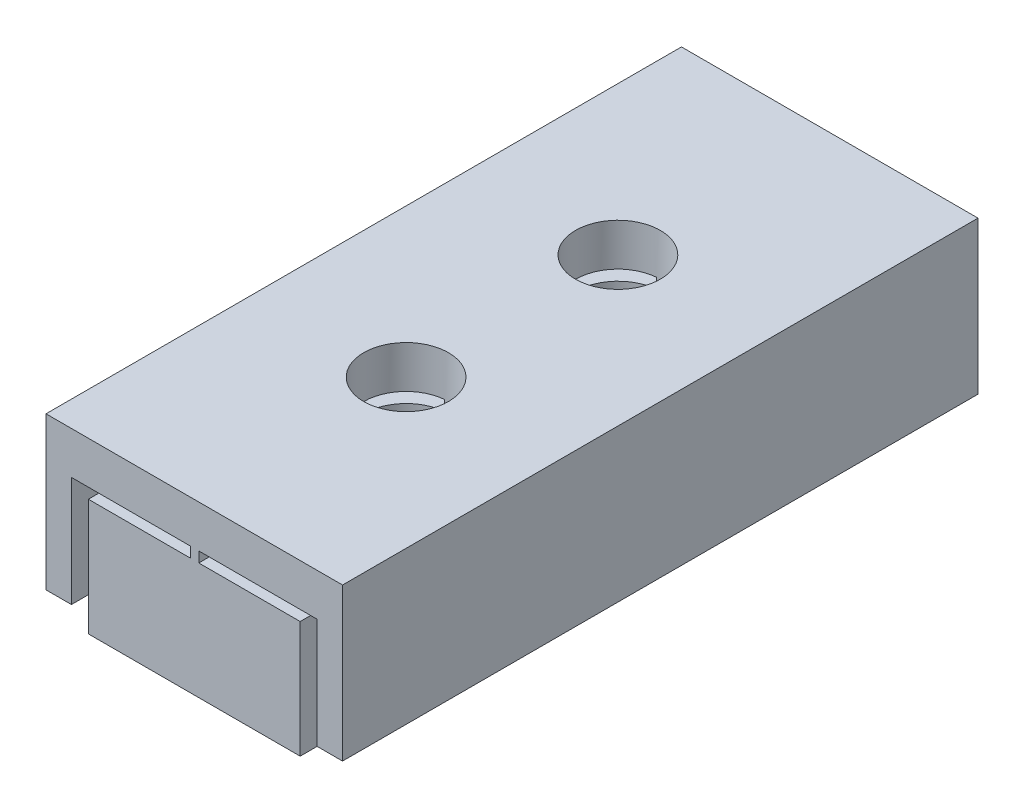
ISO-10303-21;
HEADER;
FILE_DESCRIPTION(('STEP AP214'),'2;1');
FILE_NAME('part.step','',(''),(''),'','','');
FILE_SCHEMA(('AUTOMOTIVE_DESIGN { 1 0 10303 214 1 1 1 1 }'));
ENDSEC;
DATA;
#1=APPLICATION_CONTEXT('core data for automotive mechanical design processes');
#2=APPLICATION_PROTOCOL_DEFINITION('international standard','automotive_design',2000,#1);
#3=PRODUCT_CONTEXT('',#1,'mechanical');
#4=PRODUCT('Part','Part','',(#3));
#5=PRODUCT_RELATED_PRODUCT_CATEGORY('part','',(#4));
#6=PRODUCT_DEFINITION_FORMATION('','',#4);
#7=PRODUCT_DEFINITION_CONTEXT('part definition',#1,'design');
#8=PRODUCT_DEFINITION('design','',#6,#7);
#9=PRODUCT_DEFINITION_SHAPE('','',#8);
#10=(LENGTH_UNIT() NAMED_UNIT(*) SI_UNIT(.MILLI.,.METRE.));
#11=(NAMED_UNIT(*) PLANE_ANGLE_UNIT() SI_UNIT($,.RADIAN.));
#12=(NAMED_UNIT(*) SI_UNIT($,.STERADIAN.) SOLID_ANGLE_UNIT());
#13=UNCERTAINTY_MEASURE_WITH_UNIT(LENGTH_MEASURE(1.E-05),#10,'distance_accuracy_value','');
#14=(GEOMETRIC_REPRESENTATION_CONTEXT(3) GLOBAL_UNCERTAINTY_ASSIGNED_CONTEXT((#13)) GLOBAL_UNIT_ASSIGNED_CONTEXT((#10,
#11,#12)) REPRESENTATION_CONTEXT('',''));
#15=CARTESIAN_POINT('',(0.,0.,0.));
#16=DIRECTION('',(0.,0.,1.));
#17=DIRECTION('',(1.,0.,0.));
#18=AXIS2_PLACEMENT_3D('',#15,#16,#17);
#19=CARTESIAN_POINT('',(0.,3.,0.));
#20=DIRECTION('',(-1.,0.,0.));
#21=DIRECTION('',(0.,0.,1.));
#22=AXIS2_PLACEMENT_3D('',#19,#20,#21);
#23=PLANE('',#22);
#24=DIRECTION('',(0.,-1.,0.));
#25=VECTOR('',#24,1.);
#26=CARTESIAN_POINT('',(0.,3.,0.));
#27=LINE('',#26,#25);
#28=CARTESIAN_POINT('',(0.,2.75359951218224,0.));
#29=VERTEX_POINT('',#28);
#30=CARTESIAN_POINT('',(0.,0.,0.));
#31=VERTEX_POINT('',#30);
#32=EDGE_CURVE('E269',#29,#31,#27,.T.);
#33=ORIENTED_EDGE('',*,*,#32,.F.);
#34=DIRECTION('',(0.,0.,1.));
#35=VECTOR('',#34,1.);
#36=CARTESIAN_POINT('',(0.,2.75359951218224,0.));
#37=LINE('',#36,#35);
#38=CARTESIAN_POINT('',(0.,2.75359951218224,15.));
#39=VERTEX_POINT('',#38);
#40=EDGE_CURVE('E334',#29,#39,#37,.T.);
#41=ORIENTED_EDGE('',*,*,#40,.T.);
#42=DIRECTION('',(0.,-1.,0.));
#43=VECTOR('',#42,1.);
#44=CARTESIAN_POINT('',(0.,3.,15.));
#45=LINE('',#44,#43);
#46=CARTESIAN_POINT('',(0.,0.,15.));
#47=VERTEX_POINT('',#46);
#48=EDGE_CURVE('E263',#39,#47,#45,.T.);
#49=ORIENTED_EDGE('',*,*,#48,.T.);
#50=DIRECTION('',(0.,0.,-1.));
#51=VECTOR('',#50,1.);
#52=CARTESIAN_POINT('',(0.,0.,0.));
#53=LINE('',#52,#51);
#54=EDGE_CURVE('E246',#47,#31,#53,.T.);
#55=ORIENTED_EDGE('',*,*,#54,.T.);
#56=EDGE_LOOP('',(#33,#41,#49,#55));
#57=FACE_BOUND('',#56,.T.);
#58=ADVANCED_FACE('F38',(#57),#23,.F.);
#59=CARTESIAN_POINT('',(0.,3.,0.));
#60=DIRECTION('',(0.,0.,1.));
#61=DIRECTION('',(1.,0.,0.));
#62=AXIS2_PLACEMENT_3D('',#59,#60,#61);
#63=PLANE('',#62);
#64=DIRECTION('',(0.,-1.,0.));
#65=VECTOR('',#64,1.);
#66=CARTESIAN_POINT('',(0.999999999999999,4.,0.));
#67=LINE('',#66,#65);
#68=CARTESIAN_POINT('',(0.999999999999999,4.,0.));
#69=VERTEX_POINT('',#68);
#70=CARTESIAN_POINT('',(0.999999999999999,0.4,0.));
#71=VERTEX_POINT('',#70);
#72=EDGE_CURVE('E243',#69,#71,#67,.T.);
#73=ORIENTED_EDGE('',*,*,#72,.T.);
#74=DIRECTION('',(1.,0.,0.));
#75=VECTOR('',#74,1.);
#76=CARTESIAN_POINT('',(0.4,0.4,0.));
#77=LINE('',#76,#75);
#78=CARTESIAN_POINT('',(0.4,0.4,0.));
#79=VERTEX_POINT('',#78);
#80=EDGE_CURVE('E199',#79,#71,#77,.T.);
#81=ORIENTED_EDGE('',*,*,#80,.F.);
#82=DIRECTION('',(0.,1.,0.));
#83=VECTOR('',#82,1.);
#84=CARTESIAN_POINT('',(0.4,0.,0.));
#85=LINE('',#84,#83);
#86=CARTESIAN_POINT('',(0.4,3.,0.));
#87=VERTEX_POINT('',#86);
#88=EDGE_CURVE('E229',#79,#87,#85,.T.);
#89=ORIENTED_EDGE('',*,*,#88,.T.);
#90=DIRECTION('',(-1.,0.,0.));
#91=VECTOR('',#90,1.);
#92=CARTESIAN_POINT('',(0.4,3.,0.));
#93=LINE('',#92,#91);
#94=CARTESIAN_POINT('',(-2.39325068934878,3.,0.));
#95=VERTEX_POINT('',#94);
#96=EDGE_CURVE('E233',#87,#95,#93,.T.);
#97=ORIENTED_EDGE('',*,*,#96,.T.);
#98=DIRECTION('',(0.,-1.,0.));
#99=VECTOR('',#98,1.);
#100=CARTESIAN_POINT('',(-2.39325068934878,3.,0.));
#101=LINE('',#100,#99);
#102=CARTESIAN_POINT('',(-2.39325068934878,2.75359951218224,0.));
#103=VERTEX_POINT('',#102);
#104=EDGE_CURVE('E323',#95,#103,#101,.T.);
#105=ORIENTED_EDGE('',*,*,#104,.T.);
#106=DIRECTION('',(1.,0.,0.));
#107=VECTOR('',#106,1.);
#108=CARTESIAN_POINT('',(0.,2.75359951218224,0.));
#109=LINE('',#108,#107);
#110=EDGE_CURVE('E326',#103,#29,#109,.T.);
#111=ORIENTED_EDGE('',*,*,#110,.T.);
#112=ORIENTED_EDGE('',*,*,#32,.T.);
#113=DIRECTION('',(-1.,0.,0.));
#114=VECTOR('',#113,1.);
#115=CARTESIAN_POINT('',(0.,0.,0.));
#116=LINE('',#115,#114);
#117=CARTESIAN_POINT('',(-5.,0.,0.));
#118=VERTEX_POINT('',#117);
#119=EDGE_CURVE('E254',#31,#118,#116,.T.);
#120=ORIENTED_EDGE('',*,*,#119,.T.);
#121=DIRECTION('',(0.,-1.,0.));
#122=VECTOR('',#121,1.);
#123=CARTESIAN_POINT('',(-5.,3.,0.));
#124=LINE('',#123,#122);
#125=CARTESIAN_POINT('',(-5.,2.75359951218224,0.));
#126=VERTEX_POINT('',#125);
#127=EDGE_CURVE('E267',#126,#118,#124,.T.);
#128=ORIENTED_EDGE('',*,*,#127,.F.);
#129=DIRECTION('',(1.,0.,0.));
#130=VECTOR('',#129,1.);
#131=CARTESIAN_POINT('',(-5.,2.75359951218224,0.));
#132=LINE('',#131,#130);
#133=CARTESIAN_POINT('',(-2.59036710602787,2.75359951218224,0.));
#134=VERTEX_POINT('',#133);
#135=EDGE_CURVE('E406',#126,#134,#132,.T.);
#136=ORIENTED_EDGE('',*,*,#135,.T.);
#137=DIRECTION('',(0.,1.,0.));
#138=VECTOR('',#137,1.);
#139=CARTESIAN_POINT('',(-2.59036710602787,3.,0.));
#140=LINE('',#139,#138);
#141=CARTESIAN_POINT('',(-2.59036710602787,3.,0.));
#142=VERTEX_POINT('',#141);
#143=EDGE_CURVE('E322',#134,#142,#140,.T.);
#144=ORIENTED_EDGE('',*,*,#143,.T.);
#145=CARTESIAN_POINT('',(-5.4,3.,0.));
#146=VERTEX_POINT('',#145);
#147=EDGE_CURVE('E231',#142,#146,#93,.T.);
#148=ORIENTED_EDGE('',*,*,#147,.T.);
#149=DIRECTION('',(0.,-1.,0.));
#150=VECTOR('',#149,1.);
#151=CARTESIAN_POINT('',(-5.4,3.,0.));
#152=LINE('',#151,#150);
#153=CARTESIAN_POINT('',(-5.4,0.400000000000001,0.));
#154=VERTEX_POINT('',#153);
#155=EDGE_CURVE('E235',#146,#154,#152,.T.);
#156=ORIENTED_EDGE('',*,*,#155,.T.);
#157=DIRECTION('',(1.,0.,0.));
#158=VECTOR('',#157,1.);
#159=CARTESIAN_POINT('',(-6.,0.400000000000001,0.));
#160=LINE('',#159,#158);
#161=CARTESIAN_POINT('',(-6.,0.400000000000001,0.));
#162=VERTEX_POINT('',#161);
#163=EDGE_CURVE('E52',#162,#154,#160,.T.);
#164=ORIENTED_EDGE('',*,*,#163,.F.);
#165=DIRECTION('',(0.,1.,0.));
#166=VECTOR('',#165,1.);
#167=CARTESIAN_POINT('',(-6.,0.,0.));
#168=LINE('',#167,#166);
#169=CARTESIAN_POINT('',(-6.,4.,0.));
#170=VERTEX_POINT('',#169);
#171=EDGE_CURVE('E238',#162,#170,#168,.T.);
#172=ORIENTED_EDGE('',*,*,#171,.T.);
#173=DIRECTION('',(1.,0.,0.));
#174=VECTOR('',#173,1.);
#175=CARTESIAN_POINT('',(-6.,4.,0.));
#176=LINE('',#175,#174);
#177=EDGE_CURVE('E240',#170,#69,#176,.T.);
#178=ORIENTED_EDGE('',*,*,#177,.T.);
#179=EDGE_LOOP('',(#73,#81,#89,#97,#105,#111,#112,#120,#128,#136,#144,#148,#156,#164,#172,#178));
#180=FACE_BOUND('',#179,.T.);
#181=ADVANCED_FACE('F396',(#180),#63,.F.);
#182=CARTESIAN_POINT('',(-5.,3.,0.));
#183=DIRECTION('',(1.,0.,0.));
#184=DIRECTION('',(0.,0.,-1.));
#185=AXIS2_PLACEMENT_3D('',#182,#183,#184);
#186=PLANE('',#185);
#187=DIRECTION('',(0.,-1.,0.));
#188=VECTOR('',#187,1.);
#189=CARTESIAN_POINT('',(-5.,3.,15.));
#190=LINE('',#189,#188);
#191=CARTESIAN_POINT('',(-5.,2.75359951218224,15.));
#192=VERTEX_POINT('',#191);
#193=CARTESIAN_POINT('',(-5.,0.,15.));
#194=VERTEX_POINT('',#193);
#195=EDGE_CURVE('E265',#192,#194,#190,.T.);
#196=ORIENTED_EDGE('',*,*,#195,.F.);
#197=DIRECTION('',(0.,0.,1.));
#198=VECTOR('',#197,1.);
#199=CARTESIAN_POINT('',(-5.,2.75359951218224,0.));
#200=LINE('',#199,#198);
#201=EDGE_CURVE('E320',#126,#192,#200,.T.);
#202=ORIENTED_EDGE('',*,*,#201,.F.);
#203=ORIENTED_EDGE('',*,*,#127,.T.);
#204=DIRECTION('',(0.,0.,1.));
#205=VECTOR('',#204,1.);
#206=CARTESIAN_POINT('',(-5.,0.,0.));
#207=LINE('',#206,#205);
#208=EDGE_CURVE('E257',#118,#194,#207,.T.);
#209=ORIENTED_EDGE('',*,*,#208,.T.);
#210=EDGE_LOOP('',(#196,#202,#203,#209));
#211=FACE_BOUND('',#210,.T.);
#212=ADVANCED_FACE('F439',(#211),#186,.F.);
#213=CARTESIAN_POINT('',(0.,3.,15.));
#214=DIRECTION('',(0.,0.,-1.));
#215=DIRECTION('',(-1.,0.,0.));
#216=AXIS2_PLACEMENT_3D('',#213,#214,#215);
#217=PLANE('',#216);
#218=DIRECTION('',(0.,1.,0.));
#219=VECTOR('',#218,1.);
#220=CARTESIAN_POINT('',(0.400000000000002,0.,15.));
#221=LINE('',#220,#219);
#222=CARTESIAN_POINT('',(0.400000000000002,0.4,15.));
#223=VERTEX_POINT('',#222);
#224=CARTESIAN_POINT('',(0.400000000000002,3.,15.));
#225=VERTEX_POINT('',#224);
#226=EDGE_CURVE('E214',#223,#225,#221,.T.);
#227=ORIENTED_EDGE('',*,*,#226,.F.);
#228=DIRECTION('',(1.,0.,0.));
#229=VECTOR('',#228,1.);
#230=CARTESIAN_POINT('',(0.400000000000002,0.4,15.));
#231=LINE('',#230,#229);
#232=CARTESIAN_POINT('',(1.,0.4,15.));
#233=VERTEX_POINT('',#232);
#234=EDGE_CURVE('E60',#223,#233,#231,.T.);
#235=ORIENTED_EDGE('',*,*,#234,.T.);
#236=DIRECTION('',(0.,-1.,0.));
#237=VECTOR('',#236,1.);
#238=CARTESIAN_POINT('',(1.,4.,15.));
#239=LINE('',#238,#237);
#240=CARTESIAN_POINT('',(1.,4.,15.));
#241=VERTEX_POINT('',#240);
#242=EDGE_CURVE('E212',#241,#233,#239,.T.);
#243=ORIENTED_EDGE('',*,*,#242,.F.);
#244=DIRECTION('',(1.,0.,0.));
#245=VECTOR('',#244,1.);
#246=CARTESIAN_POINT('',(-6.,4.,15.));
#247=LINE('',#246,#245);
#248=CARTESIAN_POINT('',(-6.,4.,15.));
#249=VERTEX_POINT('',#248);
#250=EDGE_CURVE('E220',#249,#241,#247,.T.);
#251=ORIENTED_EDGE('',*,*,#250,.F.);
#252=DIRECTION('',(0.,1.,0.));
#253=VECTOR('',#252,1.);
#254=CARTESIAN_POINT('',(-6.,0.,15.));
#255=LINE('',#254,#253);
#256=CARTESIAN_POINT('',(-6.,0.400000000000001,15.));
#257=VERTEX_POINT('',#256);
#258=EDGE_CURVE('E225',#257,#249,#255,.T.);
#259=ORIENTED_EDGE('',*,*,#258,.F.);
#260=DIRECTION('',(1.,0.,0.));
#261=VECTOR('',#260,1.);
#262=CARTESIAN_POINT('',(-6.,0.400000000000001,15.));
#263=LINE('',#262,#261);
#264=CARTESIAN_POINT('',(-5.4,0.400000000000001,15.));
#265=VERTEX_POINT('',#264);
#266=EDGE_CURVE('E398',#257,#265,#263,.T.);
#267=ORIENTED_EDGE('',*,*,#266,.T.);
#268=DIRECTION('',(0.,-1.,0.));
#269=VECTOR('',#268,1.);
#270=CARTESIAN_POINT('',(-5.4,3.,15.));
#271=LINE('',#270,#269);
#272=CARTESIAN_POINT('',(-5.4,3.,15.));
#273=VERTEX_POINT('',#272);
#274=EDGE_CURVE('E382',#273,#265,#271,.T.);
#275=ORIENTED_EDGE('',*,*,#274,.F.);
#276=DIRECTION('',(-1.,0.,0.));
#277=VECTOR('',#276,1.);
#278=CARTESIAN_POINT('',(0.400000000000002,3.,15.));
#279=LINE('',#278,#277);
#280=CARTESIAN_POINT('',(-2.59036710602787,3.,15.));
#281=VERTEX_POINT('',#280);
#282=EDGE_CURVE('E379',#281,#273,#279,.T.);
#283=ORIENTED_EDGE('',*,*,#282,.F.);
#284=DIRECTION('',(0.,1.,0.));
#285=VECTOR('',#284,1.);
#286=CARTESIAN_POINT('',(-2.59036710602787,3.,15.));
#287=LINE('',#286,#285);
#288=CARTESIAN_POINT('',(-2.59036710602787,2.75359951218224,15.));
#289=VERTEX_POINT('',#288);
#290=EDGE_CURVE('E315',#289,#281,#287,.T.);
#291=ORIENTED_EDGE('',*,*,#290,.F.);
#292=DIRECTION('',(1.,0.,0.));
#293=VECTOR('',#292,1.);
#294=CARTESIAN_POINT('',(-5.,2.75359951218224,15.));
#295=LINE('',#294,#293);
#296=EDGE_CURVE('E337',#192,#289,#295,.T.);
#297=ORIENTED_EDGE('',*,*,#296,.F.);
#298=ORIENTED_EDGE('',*,*,#195,.T.);
#299=DIRECTION('',(1.,0.,0.));
#300=VECTOR('',#299,1.);
#301=CARTESIAN_POINT('',(0.,0.,15.));
#302=LINE('',#301,#300);
#303=EDGE_CURVE('E260',#194,#47,#302,.T.);
#304=ORIENTED_EDGE('',*,*,#303,.T.);
#305=ORIENTED_EDGE('',*,*,#48,.F.);
#306=DIRECTION('',(1.,0.,0.));
#307=VECTOR('',#306,1.);
#308=CARTESIAN_POINT('',(0.,2.75359951218224,15.));
#309=LINE('',#308,#307);
#310=CARTESIAN_POINT('',(-2.39325068934878,2.75359951218224,15.));
#311=VERTEX_POINT('',#310);
#312=EDGE_CURVE('E327',#311,#39,#309,.T.);
#313=ORIENTED_EDGE('',*,*,#312,.F.);
#314=DIRECTION('',(0.,-1.,0.));
#315=VECTOR('',#314,1.);
#316=CARTESIAN_POINT('',(-2.39325068934878,3.,15.));
#317=LINE('',#316,#315);
#318=CARTESIAN_POINT('',(-2.39325068934878,3.,15.));
#319=VERTEX_POINT('',#318);
#320=EDGE_CURVE('E204',#319,#311,#317,.T.);
#321=ORIENTED_EDGE('',*,*,#320,.F.);
#322=EDGE_CURVE('E380',#225,#319,#279,.T.);
#323=ORIENTED_EDGE('',*,*,#322,.F.);
#324=EDGE_LOOP('',(#227,#235,#243,#251,#259,#267,#275,#283,#291,#297,#298,#304,#305,#313,#321,#323));
#325=FACE_BOUND('',#324,.T.);
#326=ADVANCED_FACE('F210',(#325),#217,.F.);
#327=CARTESIAN_POINT('',(0.,0.,0.));
#328=DIRECTION('',(0.,-1.,0.));
#329=DIRECTION('',(0.,0.,-1.));
#330=AXIS2_PLACEMENT_3D('',#327,#328,#329);
#331=PLANE('',#330);
#332=CARTESIAN_POINT('',(-2.5,0.,10.));
#333=DIRECTION('',(0.,1.,0.));
#334=DIRECTION('',(0.,0.,1.));
#335=AXIS2_PLACEMENT_3D('',#332,#333,#334);
#336=CIRCLE('',#335,1.);
#337=CARTESIAN_POINT('',(-2.5,0.,11.));
#338=VERTEX_POINT('',#337);
#339=EDGE_CURVE('E232',#338,#338,#336,.T.);
#340=ORIENTED_EDGE('',*,*,#339,.T.);
#341=EDGE_LOOP('',(#340));
#342=FACE_BOUND('',#341,.T.);
#343=CARTESIAN_POINT('',(-2.5,0.,5.));
#344=DIRECTION('',(0.,1.,0.));
#345=DIRECTION('',(0.,0.,1.));
#346=AXIS2_PLACEMENT_3D('',#343,#344,#345);
#347=CIRCLE('',#346,1.);
#348=CARTESIAN_POINT('',(-2.5,0.,6.));
#349=VERTEX_POINT('',#348);
#350=EDGE_CURVE('E373',#349,#349,#347,.T.);
#351=ORIENTED_EDGE('',*,*,#350,.T.);
#352=EDGE_LOOP('',(#351));
#353=FACE_BOUND('',#352,.T.);
#354=ORIENTED_EDGE('',*,*,#54,.F.);
#355=ORIENTED_EDGE('',*,*,#303,.F.);
#356=ORIENTED_EDGE('',*,*,#208,.F.);
#357=ORIENTED_EDGE('',*,*,#119,.F.);
#358=EDGE_LOOP('',(#354,#355,#356,#357));
#359=FACE_BOUND('',#358,.T.);
#360=ADVANCED_FACE('F448',(#342,#353,#359),#331,.T.);
#361=CARTESIAN_POINT('',(0.400000000000002,3.,15.));
#362=DIRECTION('',(0.,-1.,0.));
#363=DIRECTION('',(0.,0.,-1.));
#364=AXIS2_PLACEMENT_3D('',#361,#362,#363);
#365=PLANE('',#364);
#366=ORIENTED_EDGE('',*,*,#322,.T.);
#367=DIRECTION('',(0.,0.,1.));
#368=VECTOR('',#367,1.);
#369=CARTESIAN_POINT('',(-2.39325068934878,3.,0.));
#370=LINE('',#369,#368);
#371=CARTESIAN_POINT('',(-2.39325068934878,3.,10.9942859672526));
#372=VERTEX_POINT('',#371);
#373=EDGE_CURVE('E330',#372,#319,#370,.T.);
#374=ORIENTED_EDGE('',*,*,#373,.F.);
#375=CARTESIAN_POINT('',(-2.5,3.,10.));
#376=DIRECTION('',(0.,1.,0.));
#377=DIRECTION('',(0.,0.,1.));
#378=AXIS2_PLACEMENT_3D('',#375,#376,#377);
#379=CIRCLE('',#378,1.);
#380=CARTESIAN_POINT('',(-2.39325068934878,3.,9.00571403274738));
#381=VERTEX_POINT('',#380);
#382=EDGE_CURVE('E271',#381,#372,#379,.F.);
#383=ORIENTED_EDGE('',*,*,#382,.F.);
#384=CARTESIAN_POINT('',(-2.39325068934878,3.,5.99428596725263));
#385=VERTEX_POINT('',#384);
#386=EDGE_CURVE('E346',#385,#381,#370,.T.);
#387=ORIENTED_EDGE('',*,*,#386,.F.);
#388=CARTESIAN_POINT('',(-2.5,3.,5.));
#389=DIRECTION('',(0.,1.,0.));
#390=DIRECTION('',(0.,0.,1.));
#391=AXIS2_PLACEMENT_3D('',#388,#389,#390);
#392=CIRCLE('',#391,1.);
#393=CARTESIAN_POINT('',(-2.39325068934878,3.,4.00571403274738));
#394=VERTEX_POINT('',#393);
#395=EDGE_CURVE('E311',#394,#385,#392,.F.);
#396=ORIENTED_EDGE('',*,*,#395,.F.);
#397=EDGE_CURVE('E343',#95,#394,#370,.T.);
#398=ORIENTED_EDGE('',*,*,#397,.F.);
#399=ORIENTED_EDGE('',*,*,#96,.F.);
#400=DIRECTION('',(0.,0.,-1.));
#401=VECTOR('',#400,1.);
#402=CARTESIAN_POINT('',(0.400000000000002,3.,15.));
#403=LINE('',#402,#401);
#404=EDGE_CURVE('E219',#225,#87,#403,.T.);
#405=ORIENTED_EDGE('',*,*,#404,.F.);
#406=EDGE_LOOP('',(#366,#374,#383,#387,#396,#398,#399,#405));
#407=FACE_BOUND('',#406,.T.);
#408=ADVANCED_FACE('F482',(#407),#365,.T.);
#409=ORIENTED_EDGE('',*,*,#147,.F.);
#410=DIRECTION('',(0.,0.,1.));
#411=VECTOR('',#410,1.);
#412=CARTESIAN_POINT('',(-2.59036710602787,3.,0.));
#413=LINE('',#412,#411);
#414=CARTESIAN_POINT('',(-2.59036710602787,3.,4.00409147701802));
#415=VERTEX_POINT('',#414);
#416=EDGE_CURVE('E308',#142,#415,#413,.T.);
#417=ORIENTED_EDGE('',*,*,#416,.T.);
#418=CARTESIAN_POINT('',(-2.5,3.,5.));
#419=DIRECTION('',(0.,1.,0.));
#420=DIRECTION('',(0.,0.,1.));
#421=AXIS2_PLACEMENT_3D('',#418,#419,#420);
#422=CIRCLE('',#421,1.);
#423=CARTESIAN_POINT('',(-2.59036710602787,3.,5.99590852298198));
#424=VERTEX_POINT('',#423);
#425=EDGE_CURVE('E307',#424,#415,#422,.F.);
#426=ORIENTED_EDGE('',*,*,#425,.F.);
#427=CARTESIAN_POINT('',(-2.59036710602787,3.,9.00409147701802));
#428=VERTEX_POINT('',#427);
#429=EDGE_CURVE('E298',#424,#428,#413,.T.);
#430=ORIENTED_EDGE('',*,*,#429,.T.);
#431=CARTESIAN_POINT('',(-2.5,3.,10.));
#432=DIRECTION('',(0.,1.,0.));
#433=DIRECTION('',(0.,0.,1.));
#434=AXIS2_PLACEMENT_3D('',#431,#432,#433);
#435=CIRCLE('',#434,1.);
#436=CARTESIAN_POINT('',(-2.59036710602787,3.,10.995908522982));
#437=VERTEX_POINT('',#436);
#438=EDGE_CURVE('E11',#437,#428,#435,.F.);
#439=ORIENTED_EDGE('',*,*,#438,.F.);
#440=EDGE_CURVE('E309',#437,#281,#413,.T.);
#441=ORIENTED_EDGE('',*,*,#440,.T.);
#442=ORIENTED_EDGE('',*,*,#282,.T.);
#443=DIRECTION('',(0.,0.,-1.));
#444=VECTOR('',#443,1.);
#445=CARTESIAN_POINT('',(-5.4,3.,15.));
#446=LINE('',#445,#444);
#447=EDGE_CURVE('E223',#273,#146,#446,.T.);
#448=ORIENTED_EDGE('',*,*,#447,.T.);
#449=EDGE_LOOP('',(#409,#417,#426,#430,#439,#441,#442,#448));
#450=FACE_BOUND('',#449,.T.);
#451=ADVANCED_FACE('F302',(#450),#365,.T.);
#452=CARTESIAN_POINT('',(1.,4.,15.));
#453=DIRECTION('',(1.,0.,0.));
#454=DIRECTION('',(0.,0.,-1.));
#455=AXIS2_PLACEMENT_3D('',#452,#453,#454);
#456=PLANE('',#455);
#457=DIRECTION('',(0.,0.,-1.));
#458=VECTOR('',#457,1.);
#459=CARTESIAN_POINT('',(1.,0.4,15.));
#460=LINE('',#459,#458);
#461=EDGE_CURVE('E196',#233,#71,#460,.T.);
#462=ORIENTED_EDGE('',*,*,#461,.T.);
#463=ORIENTED_EDGE('',*,*,#72,.F.);
#464=DIRECTION('',(0.,0.,-1.));
#465=VECTOR('',#464,1.);
#466=CARTESIAN_POINT('',(1.,4.,15.));
#467=LINE('',#466,#465);
#468=EDGE_CURVE('E217',#241,#69,#467,.T.);
#469=ORIENTED_EDGE('',*,*,#468,.F.);
#470=ORIENTED_EDGE('',*,*,#242,.T.);
#471=EDGE_LOOP('',(#462,#463,#469,#470));
#472=FACE_BOUND('',#471,.T.);
#473=ADVANCED_FACE('F216',(#472),#456,.T.);
#474=CARTESIAN_POINT('',(-6.,4.,15.));
#475=DIRECTION('',(0.,1.,0.));
#476=DIRECTION('',(0.,0.,1.));
#477=AXIS2_PLACEMENT_3D('',#474,#475,#476);
#478=PLANE('',#477);
#479=CARTESIAN_POINT('',(-2.5,4.,10.));
#480=DIRECTION('',(0.,1.,0.));
#481=DIRECTION('',(0.,0.,1.));
#482=AXIS2_PLACEMENT_3D('',#479,#480,#481);
#483=CIRCLE('',#482,1.);
#484=CARTESIAN_POINT('',(-2.5,4.,11.));
#485=VERTEX_POINT('',#484);
#486=EDGE_CURVE('E370',#485,#485,#483,.T.);
#487=ORIENTED_EDGE('',*,*,#486,.F.);
#488=EDGE_LOOP('',(#487));
#489=FACE_BOUND('',#488,.T.);
#490=CARTESIAN_POINT('',(-2.5,4.,5.));
#491=DIRECTION('',(0.,1.,0.));
#492=DIRECTION('',(0.,0.,1.));
#493=AXIS2_PLACEMENT_3D('',#490,#491,#492);
#494=CIRCLE('',#493,1.);
#495=CARTESIAN_POINT('',(-2.5,4.,6.));
#496=VERTEX_POINT('',#495);
#497=EDGE_CURVE('E367',#496,#496,#494,.T.);
#498=ORIENTED_EDGE('',*,*,#497,.F.);
#499=EDGE_LOOP('',(#498));
#500=FACE_BOUND('',#499,.T.);
#501=ORIENTED_EDGE('',*,*,#177,.F.);
#502=DIRECTION('',(0.,0.,-1.));
#503=VECTOR('',#502,1.);
#504=CARTESIAN_POINT('',(-6.,4.,15.));
#505=LINE('',#504,#503);
#506=EDGE_CURVE('E247',#249,#170,#505,.T.);
#507=ORIENTED_EDGE('',*,*,#506,.F.);
#508=ORIENTED_EDGE('',*,*,#250,.T.);
#509=ORIENTED_EDGE('',*,*,#468,.T.);
#510=EDGE_LOOP('',(#501,#507,#508,#509));
#511=FACE_BOUND('',#510,.T.);
#512=ADVANCED_FACE('F394',(#489,#500,#511),#478,.T.);
#513=CARTESIAN_POINT('',(-6.,0.,15.));
#514=DIRECTION('',(-1.,0.,0.));
#515=DIRECTION('',(0.,0.,1.));
#516=AXIS2_PLACEMENT_3D('',#513,#514,#515);
#517=PLANE('',#516);
#518=DIRECTION('',(0.,0.,-1.));
#519=VECTOR('',#518,1.);
#520=CARTESIAN_POINT('',(-6.,0.400000000000001,15.));
#521=LINE('',#520,#519);
#522=EDGE_CURVE('E391',#257,#162,#521,.T.);
#523=ORIENTED_EDGE('',*,*,#522,.F.);
#524=ORIENTED_EDGE('',*,*,#258,.T.);
#525=ORIENTED_EDGE('',*,*,#506,.T.);
#526=ORIENTED_EDGE('',*,*,#171,.F.);
#527=EDGE_LOOP('',(#523,#524,#525,#526));
#528=FACE_BOUND('',#527,.T.);
#529=ADVANCED_FACE('F388',(#528),#517,.T.);
#530=CARTESIAN_POINT('',(-5.4,3.,15.));
#531=DIRECTION('',(1.,0.,0.));
#532=DIRECTION('',(0.,0.,-1.));
#533=AXIS2_PLACEMENT_3D('',#530,#531,#532);
#534=PLANE('',#533);
#535=DIRECTION('',(0.,0.,-1.));
#536=VECTOR('',#535,1.);
#537=CARTESIAN_POINT('',(-5.4,0.400000000000001,15.));
#538=LINE('',#537,#536);
#539=EDGE_CURVE('E403',#265,#154,#538,.T.);
#540=ORIENTED_EDGE('',*,*,#539,.T.);
#541=ORIENTED_EDGE('',*,*,#155,.F.);
#542=ORIENTED_EDGE('',*,*,#447,.F.);
#543=ORIENTED_EDGE('',*,*,#274,.T.);
#544=EDGE_LOOP('',(#540,#541,#542,#543));
#545=FACE_BOUND('',#544,.T.);
#546=ADVANCED_FACE('F422',(#545),#534,.T.);
#547=CARTESIAN_POINT('',(0.400000000000002,0.,15.));
#548=DIRECTION('',(-1.,0.,0.));
#549=DIRECTION('',(0.,0.,1.));
#550=AXIS2_PLACEMENT_3D('',#547,#548,#549);
#551=PLANE('',#550);
#552=DIRECTION('',(0.,0.,-1.));
#553=VECTOR('',#552,1.);
#554=CARTESIAN_POINT('',(0.400000000000002,0.4,15.));
#555=LINE('',#554,#553);
#556=EDGE_CURVE('E205',#223,#79,#555,.T.);
#557=ORIENTED_EDGE('',*,*,#556,.F.);
#558=ORIENTED_EDGE('',*,*,#226,.T.);
#559=ORIENTED_EDGE('',*,*,#404,.T.);
#560=ORIENTED_EDGE('',*,*,#88,.F.);
#561=EDGE_LOOP('',(#557,#558,#559,#560));
#562=FACE_BOUND('',#561,.T.);
#563=ADVANCED_FACE('F460',(#562),#551,.T.);
#564=CARTESIAN_POINT('',(-2.5,0.,5.));
#565=DIRECTION('',(0.,1.,0.));
#566=DIRECTION('',(0.,0.,1.));
#567=AXIS2_PLACEMENT_3D('',#564,#565,#566);
#568=CYLINDRICAL_SURFACE('',#567,1.);
#569=DIRECTION('',(0.,1.,0.));
#570=VECTOR('',#569,1.);
#571=CARTESIAN_POINT('',(-2.59036710602787,0.,5.99590852298198));
#572=LINE('',#571,#570);
#573=CARTESIAN_POINT('',(-2.59036710602787,2.75359951218224,5.99590852298198));
#574=VERTEX_POINT('',#573);
#575=EDGE_CURVE('E361',#574,#424,#572,.T.);
#576=ORIENTED_EDGE('',*,*,#575,.T.);
#577=ORIENTED_EDGE('',*,*,#425,.T.);
#578=DIRECTION('',(0.,1.,0.));
#579=VECTOR('',#578,1.);
#580=CARTESIAN_POINT('',(-2.59036710602787,0.,4.00409147701802));
#581=LINE('',#580,#579);
#582=CARTESIAN_POINT('',(-2.59036710602787,2.75359951218224,4.00409147701802));
#583=VERTEX_POINT('',#582);
#584=EDGE_CURVE('E363',#415,#583,#581,.F.);
#585=ORIENTED_EDGE('',*,*,#584,.T.);
#586=CARTESIAN_POINT('',(-2.5,2.75359951218224,5.));
#587=DIRECTION('',(0.,-1.,0.));
#588=DIRECTION('',(0.,0.,-1.));
#589=AXIS2_PLACEMENT_3D('',#586,#587,#588);
#590=CIRCLE('',#589,1.);
#591=EDGE_CURVE('E358',#583,#574,#590,.F.);
#592=ORIENTED_EDGE('',*,*,#591,.T.);
#593=EDGE_LOOP('',(#576,#577,#585,#592));
#594=FACE_BOUND('',#593,.T.);
#595=DIRECTION('',(0.,1.,0.));
#596=VECTOR('',#595,1.);
#597=CARTESIAN_POINT('',(-2.39325068934878,0.,5.99428596725263));
#598=LINE('',#597,#596);
#599=CARTESIAN_POINT('',(-2.39325068934878,2.75359951218224,5.99428596725263));
#600=VERTEX_POINT('',#599);
#601=EDGE_CURVE('E352',#385,#600,#598,.F.);
#602=ORIENTED_EDGE('',*,*,#601,.T.);
#603=CARTESIAN_POINT('',(-2.5,2.75359951218224,5.));
#604=DIRECTION('',(0.,-1.,0.));
#605=DIRECTION('',(0.,0.,-1.));
#606=AXIS2_PLACEMENT_3D('',#603,#604,#605);
#607=CIRCLE('',#606,1.);
#608=CARTESIAN_POINT('',(-2.39325068934878,2.75359951218224,4.00571403274738));
#609=VERTEX_POINT('',#608);
#610=EDGE_CURVE('E355',#600,#609,#607,.F.);
#611=ORIENTED_EDGE('',*,*,#610,.T.);
#612=DIRECTION('',(0.,1.,0.));
#613=VECTOR('',#612,1.);
#614=CARTESIAN_POINT('',(-2.39325068934878,0.,4.00571403274738));
#615=LINE('',#614,#613);
#616=EDGE_CURVE('E349',#609,#394,#615,.T.);
#617=ORIENTED_EDGE('',*,*,#616,.T.);
#618=ORIENTED_EDGE('',*,*,#395,.T.);
#619=EDGE_LOOP('',(#602,#611,#617,#618));
#620=FACE_BOUND('',#619,.T.);
#621=ORIENTED_EDGE('',*,*,#350,.F.);
#622=EDGE_LOOP('',(#621));
#623=FACE_BOUND('',#622,.T.);
#624=ORIENTED_EDGE('',*,*,#497,.T.);
#625=EDGE_LOOP('',(#624));
#626=FACE_BOUND('',#625,.T.);
#627=ADVANCED_FACE('F457',(#594,#620,#623,#626),#568,.F.);
#628=CARTESIAN_POINT('',(-2.5,0.,10.));
#629=DIRECTION('',(0.,1.,0.));
#630=DIRECTION('',(0.,0.,1.));
#631=AXIS2_PLACEMENT_3D('',#628,#629,#630);
#632=CYLINDRICAL_SURFACE('',#631,1.);
#633=DIRECTION('',(0.,1.,0.));
#634=VECTOR('',#633,1.);
#635=CARTESIAN_POINT('',(-2.59036710602787,0.,10.995908522982));
#636=LINE('',#635,#634);
#637=CARTESIAN_POINT('',(-2.59036710602787,2.75359951218224,10.995908522982));
#638=VERTEX_POINT('',#637);
#639=EDGE_CURVE('E286',#638,#437,#636,.T.);
#640=ORIENTED_EDGE('',*,*,#639,.T.);
#641=ORIENTED_EDGE('',*,*,#438,.T.);
#642=DIRECTION('',(0.,1.,0.));
#643=VECTOR('',#642,1.);
#644=CARTESIAN_POINT('',(-2.59036710602787,0.,9.00409147701802));
#645=LINE('',#644,#643);
#646=CARTESIAN_POINT('',(-2.59036710602787,2.75359951218224,9.00409147701802));
#647=VERTEX_POINT('',#646);
#648=EDGE_CURVE('E45',#428,#647,#645,.F.);
#649=ORIENTED_EDGE('',*,*,#648,.T.);
#650=CARTESIAN_POINT('',(-2.5,2.75359951218224,10.));
#651=DIRECTION('',(0.,-1.,0.));
#652=DIRECTION('',(0.,0.,-1.));
#653=AXIS2_PLACEMENT_3D('',#650,#651,#652);
#654=CIRCLE('',#653,1.);
#655=EDGE_CURVE('E283',#647,#638,#654,.F.);
#656=ORIENTED_EDGE('',*,*,#655,.T.);
#657=EDGE_LOOP('',(#640,#641,#649,#656));
#658=FACE_BOUND('',#657,.T.);
#659=DIRECTION('',(0.,1.,0.));
#660=VECTOR('',#659,1.);
#661=CARTESIAN_POINT('',(-2.39325068934878,0.,10.9942859672526));
#662=LINE('',#661,#660);
#663=CARTESIAN_POINT('',(-2.39325068934878,2.75359951218224,10.9942859672526));
#664=VERTEX_POINT('',#663);
#665=EDGE_CURVE('E277',#372,#664,#662,.F.);
#666=ORIENTED_EDGE('',*,*,#665,.T.);
#667=CARTESIAN_POINT('',(-2.5,2.75359951218224,10.));
#668=DIRECTION('',(0.,-1.,0.));
#669=DIRECTION('',(0.,0.,-1.));
#670=AXIS2_PLACEMENT_3D('',#667,#668,#669);
#671=CIRCLE('',#670,1.);
#672=CARTESIAN_POINT('',(-2.39325068934878,2.75359951218224,9.00571403274738));
#673=VERTEX_POINT('',#672);
#674=EDGE_CURVE('E280',#664,#673,#671,.F.);
#675=ORIENTED_EDGE('',*,*,#674,.T.);
#676=DIRECTION('',(0.,1.,0.));
#677=VECTOR('',#676,1.);
#678=CARTESIAN_POINT('',(-2.39325068934878,0.,9.00571403274738));
#679=LINE('',#678,#677);
#680=EDGE_CURVE('E274',#673,#381,#679,.T.);
#681=ORIENTED_EDGE('',*,*,#680,.T.);
#682=ORIENTED_EDGE('',*,*,#382,.T.);
#683=EDGE_LOOP('',(#666,#675,#681,#682));
#684=FACE_BOUND('',#683,.T.);
#685=ORIENTED_EDGE('',*,*,#339,.F.);
#686=EDGE_LOOP('',(#685));
#687=FACE_BOUND('',#686,.T.);
#688=ORIENTED_EDGE('',*,*,#486,.T.);
#689=EDGE_LOOP('',(#688));
#690=FACE_BOUND('',#689,.T.);
#691=ADVANCED_FACE('F290',(#658,#684,#687,#690),#632,.F.);
#692=CARTESIAN_POINT('',(0.,2.75359951218224,0.));
#693=DIRECTION('',(0.,-1.,0.));
#694=DIRECTION('',(0.,0.,-1.));
#695=AXIS2_PLACEMENT_3D('',#692,#693,#694);
#696=PLANE('',#695);
#697=DIRECTION('',(0.,0.,1.));
#698=VECTOR('',#697,1.);
#699=CARTESIAN_POINT('',(-2.39325068934878,2.75359951218224,0.));
#700=LINE('',#699,#698);
#701=EDGE_CURVE('E341',#600,#673,#700,.T.);
#702=ORIENTED_EDGE('',*,*,#701,.T.);
#703=ORIENTED_EDGE('',*,*,#674,.F.);
#704=EDGE_CURVE('E342',#664,#311,#700,.T.);
#705=ORIENTED_EDGE('',*,*,#704,.T.);
#706=ORIENTED_EDGE('',*,*,#312,.T.);
#707=ORIENTED_EDGE('',*,*,#40,.F.);
#708=ORIENTED_EDGE('',*,*,#110,.F.);
#709=EDGE_CURVE('E338',#103,#609,#700,.T.);
#710=ORIENTED_EDGE('',*,*,#709,.T.);
#711=ORIENTED_EDGE('',*,*,#610,.F.);
#712=EDGE_LOOP('',(#702,#703,#705,#706,#707,#708,#710,#711));
#713=FACE_BOUND('',#712,.T.);
#714=ADVANCED_FACE('F527',(#713),#696,.F.);
#715=CARTESIAN_POINT('',(-2.39325068934878,3.,0.));
#716=DIRECTION('',(-1.,0.,0.));
#717=DIRECTION('',(0.,0.,1.));
#718=AXIS2_PLACEMENT_3D('',#715,#716,#717);
#719=PLANE('',#718);
#720=ORIENTED_EDGE('',*,*,#386,.T.);
#721=ORIENTED_EDGE('',*,*,#680,.F.);
#722=ORIENTED_EDGE('',*,*,#701,.F.);
#723=ORIENTED_EDGE('',*,*,#601,.F.);
#724=EDGE_LOOP('',(#720,#721,#722,#723));
#725=FACE_BOUND('',#724,.T.);
#726=ADVANCED_FACE('F532',(#725),#719,.F.);
#727=ORIENTED_EDGE('',*,*,#709,.F.);
#728=ORIENTED_EDGE('',*,*,#104,.F.);
#729=ORIENTED_EDGE('',*,*,#397,.T.);
#730=ORIENTED_EDGE('',*,*,#616,.F.);
#731=EDGE_LOOP('',(#727,#728,#729,#730));
#732=FACE_BOUND('',#731,.T.);
#733=ADVANCED_FACE('F542',(#732),#719,.F.);
#734=ORIENTED_EDGE('',*,*,#373,.T.);
#735=ORIENTED_EDGE('',*,*,#320,.T.);
#736=ORIENTED_EDGE('',*,*,#704,.F.);
#737=ORIENTED_EDGE('',*,*,#665,.F.);
#738=EDGE_LOOP('',(#734,#735,#736,#737));
#739=FACE_BOUND('',#738,.T.);
#740=ADVANCED_FACE('F545',(#739),#719,.F.);
#741=CARTESIAN_POINT('',(-2.59036710602787,3.,0.));
#742=DIRECTION('',(1.,0.,0.));
#743=DIRECTION('',(0.,0.,-1.));
#744=AXIS2_PLACEMENT_3D('',#741,#742,#743);
#745=PLANE('',#744);
#746=ORIENTED_EDGE('',*,*,#416,.F.);
#747=ORIENTED_EDGE('',*,*,#143,.F.);
#748=DIRECTION('',(0.,0.,1.));
#749=VECTOR('',#748,1.);
#750=CARTESIAN_POINT('',(-2.59036710602787,2.75359951218224,0.));
#751=LINE('',#750,#749);
#752=EDGE_CURVE('E312',#134,#583,#751,.T.);
#753=ORIENTED_EDGE('',*,*,#752,.T.);
#754=ORIENTED_EDGE('',*,*,#584,.F.);
#755=EDGE_LOOP('',(#746,#747,#753,#754));
#756=FACE_BOUND('',#755,.T.);
#757=ADVANCED_FACE('F455',(#756),#745,.F.);
#758=EDGE_CURVE('E300',#574,#647,#751,.T.);
#759=ORIENTED_EDGE('',*,*,#758,.T.);
#760=ORIENTED_EDGE('',*,*,#648,.F.);
#761=ORIENTED_EDGE('',*,*,#429,.F.);
#762=ORIENTED_EDGE('',*,*,#575,.F.);
#763=EDGE_LOOP('',(#759,#760,#761,#762));
#764=FACE_BOUND('',#763,.T.);
#765=ADVANCED_FACE('F296',(#764),#745,.F.);
#766=EDGE_CURVE('E319',#638,#289,#751,.T.);
#767=ORIENTED_EDGE('',*,*,#766,.T.);
#768=ORIENTED_EDGE('',*,*,#290,.T.);
#769=ORIENTED_EDGE('',*,*,#440,.F.);
#770=ORIENTED_EDGE('',*,*,#639,.F.);
#771=EDGE_LOOP('',(#767,#768,#769,#770));
#772=FACE_BOUND('',#771,.T.);
#773=ADVANCED_FACE('F416',(#772),#745,.F.);
#774=CARTESIAN_POINT('',(-5.,2.75359951218224,0.));
#775=DIRECTION('',(0.,-1.,0.));
#776=DIRECTION('',(0.,0.,-1.));
#777=AXIS2_PLACEMENT_3D('',#774,#775,#776);
#778=PLANE('',#777);
#779=ORIENTED_EDGE('',*,*,#752,.F.);
#780=ORIENTED_EDGE('',*,*,#135,.F.);
#781=ORIENTED_EDGE('',*,*,#201,.T.);
#782=ORIENTED_EDGE('',*,*,#296,.T.);
#783=ORIENTED_EDGE('',*,*,#766,.F.);
#784=ORIENTED_EDGE('',*,*,#655,.F.);
#785=ORIENTED_EDGE('',*,*,#758,.F.);
#786=ORIENTED_EDGE('',*,*,#591,.F.);
#787=EDGE_LOOP('',(#779,#780,#781,#782,#783,#784,#785,#786));
#788=FACE_BOUND('',#787,.T.);
#789=ADVANCED_FACE('F429',(#788),#778,.F.);
#790=CARTESIAN_POINT('',(0.400000000000002,0.4,15.));
#791=DIRECTION('',(0.,1.,0.));
#792=DIRECTION('',(-1.,0.,0.));
#793=AXIS2_PLACEMENT_3D('',#790,#791,#792);
#794=PLANE('',#793);
#795=ORIENTED_EDGE('',*,*,#80,.T.);
#796=ORIENTED_EDGE('',*,*,#461,.F.);
#797=ORIENTED_EDGE('',*,*,#234,.F.);
#798=ORIENTED_EDGE('',*,*,#556,.T.);
#799=EDGE_LOOP('',(#795,#796,#797,#798));
#800=FACE_BOUND('',#799,.T.);
#801=ADVANCED_FACE('F197',(#800),#794,.F.);
#802=CARTESIAN_POINT('',(-6.,0.400000000000001,15.));
#803=DIRECTION('',(0.,1.,0.));
#804=DIRECTION('',(-1.,0.,0.));
#805=AXIS2_PLACEMENT_3D('',#802,#803,#804);
#806=PLANE('',#805);
#807=ORIENTED_EDGE('',*,*,#163,.T.);
#808=ORIENTED_EDGE('',*,*,#539,.F.);
#809=ORIENTED_EDGE('',*,*,#266,.F.);
#810=ORIENTED_EDGE('',*,*,#522,.T.);
#811=EDGE_LOOP('',(#807,#808,#809,#810));
#812=FACE_BOUND('',#811,.T.);
#813=ADVANCED_FACE('F423',(#812),#806,.F.);
#814=CLOSED_SHELL('',(#58,#181,#212,#326,#360,#408,#451,#473,#512,#529,#546,#563,#627,#691,#714,
#726,#733,#740,#757,#765,#773,#789,#801,#813));
#815=MANIFOLD_SOLID_BREP('B2',#814);
#816=ADVANCED_BREP_SHAPE_REPRESENTATION('',(#18,#815),#14);
#817=SHAPE_DEFINITION_REPRESENTATION(#9,#816);
ENDSEC;
END-ISO-10303-21;
